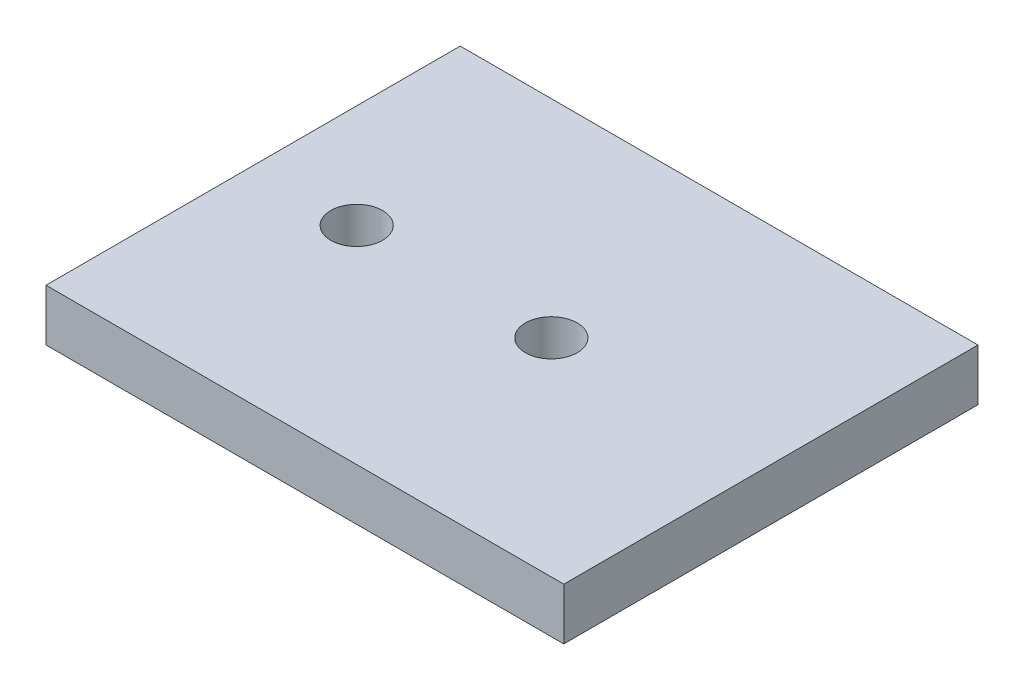
ISO-10303-21;
HEADER;
FILE_DESCRIPTION(('STEP AP214'),'2;1');
FILE_NAME('part.step','',(''),(''),'','','');
FILE_SCHEMA(('AUTOMOTIVE_DESIGN { 1 0 10303 214 1 1 1 1 }'));
ENDSEC;
DATA;
#1=APPLICATION_CONTEXT('core data for automotive mechanical design processes');
#2=APPLICATION_PROTOCOL_DEFINITION('international standard','automotive_design',2000,#1);
#3=PRODUCT_CONTEXT('',#1,'mechanical');
#4=PRODUCT('Part','Part','',(#3));
#5=PRODUCT_RELATED_PRODUCT_CATEGORY('part','',(#4));
#6=PRODUCT_DEFINITION_FORMATION('','',#4);
#7=PRODUCT_DEFINITION_CONTEXT('part definition',#1,'design');
#8=PRODUCT_DEFINITION('design','',#6,#7);
#9=PRODUCT_DEFINITION_SHAPE('','',#8);
#10=(LENGTH_UNIT() NAMED_UNIT(*) SI_UNIT(.MILLI.,.METRE.));
#11=(NAMED_UNIT(*) PLANE_ANGLE_UNIT() SI_UNIT($,.RADIAN.));
#12=(NAMED_UNIT(*) SI_UNIT($,.STERADIAN.) SOLID_ANGLE_UNIT());
#13=UNCERTAINTY_MEASURE_WITH_UNIT(LENGTH_MEASURE(1.E-05),#10,'distance_accuracy_value','');
#14=(GEOMETRIC_REPRESENTATION_CONTEXT(3) GLOBAL_UNCERTAINTY_ASSIGNED_CONTEXT((#13)) GLOBAL_UNIT_ASSIGNED_CONTEXT((#10,
#11,#12)) REPRESENTATION_CONTEXT('',''));
#15=CARTESIAN_POINT('',(0.,0.,0.));
#16=DIRECTION('',(0.,0.,1.));
#17=DIRECTION('',(1.,0.,0.));
#18=AXIS2_PLACEMENT_3D('',#15,#16,#17);
#19=CARTESIAN_POINT('',(63.5,12.7,-50.8));
#20=DIRECTION('',(-1.,0.,0.));
#21=DIRECTION('',(0.,0.,1.));
#22=AXIS2_PLACEMENT_3D('',#19,#20,#21);
#23=PLANE('',#22);
#24=DIRECTION('',(0.,0.,-1.));
#25=VECTOR('',#24,1.);
#26=CARTESIAN_POINT('',(63.5,0.,-50.8));
#27=LINE('',#26,#25);
#28=CARTESIAN_POINT('',(63.5,0.,50.8));
#29=VERTEX_POINT('',#28);
#30=CARTESIAN_POINT('',(63.5,0.,-50.8));
#31=VERTEX_POINT('',#30);
#32=EDGE_CURVE('E107',#29,#31,#27,.T.);
#33=ORIENTED_EDGE('',*,*,#32,.T.);
#34=DIRECTION('',(0.,-1.,0.));
#35=VECTOR('',#34,1.);
#36=CARTESIAN_POINT('',(63.5,12.7,-50.8));
#37=LINE('',#36,#35);
#38=CARTESIAN_POINT('',(63.5,12.7,-50.8));
#39=VERTEX_POINT('',#38);
#40=EDGE_CURVE('E11',#39,#31,#37,.T.);
#41=ORIENTED_EDGE('',*,*,#40,.F.);
#42=DIRECTION('',(0.,0.,-1.));
#43=VECTOR('',#42,1.);
#44=CARTESIAN_POINT('',(63.5,12.7,-50.8));
#45=LINE('',#44,#43);
#46=CARTESIAN_POINT('',(63.5,12.7,50.8));
#47=VERTEX_POINT('',#46);
#48=EDGE_CURVE('E91',#47,#39,#45,.T.);
#49=ORIENTED_EDGE('',*,*,#48,.F.);
#50=DIRECTION('',(0.,-1.,0.));
#51=VECTOR('',#50,1.);
#52=CARTESIAN_POINT('',(63.5,12.7,50.8));
#53=LINE('',#52,#51);
#54=EDGE_CURVE('E103',#47,#29,#53,.T.);
#55=ORIENTED_EDGE('',*,*,#54,.T.);
#56=EDGE_LOOP('',(#33,#41,#49,#55));
#57=FACE_BOUND('',#56,.T.);
#58=ADVANCED_FACE('F39',(#57),#23,.F.);
#59=CARTESIAN_POINT('',(-63.5,12.7,-50.8));
#60=DIRECTION('',(0.,0.,1.));
#61=DIRECTION('',(1.,0.,0.));
#62=AXIS2_PLACEMENT_3D('',#59,#60,#61);
#63=PLANE('',#62);
#64=DIRECTION('',(-1.,0.,0.));
#65=VECTOR('',#64,1.);
#66=CARTESIAN_POINT('',(-63.5,0.,-50.8));
#67=LINE('',#66,#65);
#68=CARTESIAN_POINT('',(-63.5,0.,-50.8));
#69=VERTEX_POINT('',#68);
#70=EDGE_CURVE('E96',#31,#69,#67,.T.);
#71=ORIENTED_EDGE('',*,*,#70,.T.);
#72=DIRECTION('',(0.,-1.,0.));
#73=VECTOR('',#72,1.);
#74=CARTESIAN_POINT('',(-63.5,12.7,-50.8));
#75=LINE('',#74,#73);
#76=CARTESIAN_POINT('',(-63.5,12.7,-50.8));
#77=VERTEX_POINT('',#76);
#78=EDGE_CURVE('E48',#77,#69,#75,.T.);
#79=ORIENTED_EDGE('',*,*,#78,.F.);
#80=DIRECTION('',(-1.,0.,0.));
#81=VECTOR('',#80,1.);
#82=CARTESIAN_POINT('',(-63.5,12.7,-50.8));
#83=LINE('',#82,#81);
#84=EDGE_CURVE('E86',#39,#77,#83,.T.);
#85=ORIENTED_EDGE('',*,*,#84,.F.);
#86=ORIENTED_EDGE('',*,*,#40,.T.);
#87=EDGE_LOOP('',(#71,#79,#85,#86));
#88=FACE_BOUND('',#87,.T.);
#89=ADVANCED_FACE('F95',(#88),#63,.F.);
#90=CARTESIAN_POINT('',(-63.5,12.7,-50.8));
#91=DIRECTION('',(1.,0.,0.));
#92=DIRECTION('',(0.,0.,-1.));
#93=AXIS2_PLACEMENT_3D('',#90,#91,#92);
#94=PLANE('',#93);
#95=DIRECTION('',(0.,0.,1.));
#96=VECTOR('',#95,1.);
#97=CARTESIAN_POINT('',(-63.5,0.,-50.8));
#98=LINE('',#97,#96);
#99=CARTESIAN_POINT('',(-63.5,0.,50.8));
#100=VERTEX_POINT('',#99);
#101=EDGE_CURVE('E73',#69,#100,#98,.T.);
#102=ORIENTED_EDGE('',*,*,#101,.T.);
#103=DIRECTION('',(0.,-1.,0.));
#104=VECTOR('',#103,1.);
#105=CARTESIAN_POINT('',(-63.5,12.7,50.8));
#106=LINE('',#105,#104);
#107=CARTESIAN_POINT('',(-63.5,12.7,50.8));
#108=VERTEX_POINT('',#107);
#109=EDGE_CURVE('E98',#108,#100,#106,.T.);
#110=ORIENTED_EDGE('',*,*,#109,.F.);
#111=DIRECTION('',(0.,0.,1.));
#112=VECTOR('',#111,1.);
#113=CARTESIAN_POINT('',(-63.5,12.7,-50.8));
#114=LINE('',#113,#112);
#115=EDGE_CURVE('E89',#77,#108,#114,.T.);
#116=ORIENTED_EDGE('',*,*,#115,.F.);
#117=ORIENTED_EDGE('',*,*,#78,.T.);
#118=EDGE_LOOP('',(#102,#110,#116,#117));
#119=FACE_BOUND('',#118,.T.);
#120=ADVANCED_FACE('F99',(#119),#94,.F.);
#121=CARTESIAN_POINT('',(-63.5,12.7,50.8));
#122=DIRECTION('',(0.,0.,-1.));
#123=DIRECTION('',(-1.,0.,0.));
#124=AXIS2_PLACEMENT_3D('',#121,#122,#123);
#125=PLANE('',#124);
#126=DIRECTION('',(1.,0.,0.));
#127=VECTOR('',#126,1.);
#128=CARTESIAN_POINT('',(-63.5,0.,50.8));
#129=LINE('',#128,#127);
#130=EDGE_CURVE('E79',#100,#29,#129,.T.);
#131=ORIENTED_EDGE('',*,*,#130,.T.);
#132=ORIENTED_EDGE('',*,*,#54,.F.);
#133=DIRECTION('',(1.,0.,0.));
#134=VECTOR('',#133,1.);
#135=CARTESIAN_POINT('',(-63.5,12.7,50.8));
#136=LINE('',#135,#134);
#137=EDGE_CURVE('E56',#108,#47,#136,.T.);
#138=ORIENTED_EDGE('',*,*,#137,.F.);
#139=ORIENTED_EDGE('',*,*,#109,.T.);
#140=EDGE_LOOP('',(#131,#132,#138,#139));
#141=FACE_BOUND('',#140,.T.);
#142=ADVANCED_FACE('F121',(#141),#125,.F.);
#143=CARTESIAN_POINT('',(0.,12.7,0.));
#144=DIRECTION('',(0.,1.,0.));
#145=DIRECTION('',(0.,0.,1.));
#146=AXIS2_PLACEMENT_3D('',#143,#144,#145);
#147=PLANE('',#146);
#148=CARTESIAN_POINT('',(-38.1,12.7,0.));
#149=DIRECTION('',(0.,1.,0.));
#150=DIRECTION('',(0.,0.,1.));
#151=AXIS2_PLACEMENT_3D('',#148,#149,#150);
#152=CIRCLE('',#151,6.35);
#153=CARTESIAN_POINT('',(-38.1,12.7,6.35));
#154=VERTEX_POINT('',#153);
#155=EDGE_CURVE('E136',#154,#154,#152,.T.);
#156=ORIENTED_EDGE('',*,*,#155,.F.);
#157=EDGE_LOOP('',(#156));
#158=FACE_BOUND('',#157,.T.);
#159=CARTESIAN_POINT('',(9.65199999999998,12.7,0.));
#160=DIRECTION('',(0.,1.,0.));
#161=DIRECTION('',(0.,0.,1.));
#162=AXIS2_PLACEMENT_3D('',#159,#160,#161);
#163=CIRCLE('',#162,6.35);
#164=CARTESIAN_POINT('',(9.65199999999998,12.7,6.35));
#165=VERTEX_POINT('',#164);
#166=EDGE_CURVE('E128',#165,#165,#163,.T.);
#167=ORIENTED_EDGE('',*,*,#166,.F.);
#168=EDGE_LOOP('',(#167));
#169=FACE_BOUND('',#168,.T.);
#170=ORIENTED_EDGE('',*,*,#48,.T.);
#171=ORIENTED_EDGE('',*,*,#84,.T.);
#172=ORIENTED_EDGE('',*,*,#115,.T.);
#173=ORIENTED_EDGE('',*,*,#137,.T.);
#174=EDGE_LOOP('',(#170,#171,#172,#173));
#175=FACE_BOUND('',#174,.T.);
#176=ADVANCED_FACE('F87',(#158,#169,#175),#147,.T.);
#177=CARTESIAN_POINT('',(0.,0.,0.));
#178=DIRECTION('',(0.,1.,0.));
#179=DIRECTION('',(0.,0.,1.));
#180=AXIS2_PLACEMENT_3D('',#177,#178,#179);
#181=PLANE('',#180);
#182=CARTESIAN_POINT('',(-38.1,0.,0.));
#183=DIRECTION('',(0.,1.,0.));
#184=DIRECTION('',(0.,0.,1.));
#185=AXIS2_PLACEMENT_3D('',#182,#183,#184);
#186=CIRCLE('',#185,6.35);
#187=CARTESIAN_POINT('',(-38.1,0.,6.35));
#188=VERTEX_POINT('',#187);
#189=EDGE_CURVE('E111',#188,#188,#186,.T.);
#190=ORIENTED_EDGE('',*,*,#189,.T.);
#191=EDGE_LOOP('',(#190));
#192=FACE_BOUND('',#191,.T.);
#193=CARTESIAN_POINT('',(9.65199999999998,0.,0.));
#194=DIRECTION('',(0.,1.,0.));
#195=DIRECTION('',(0.,0.,1.));
#196=AXIS2_PLACEMENT_3D('',#193,#194,#195);
#197=CIRCLE('',#196,6.35);
#198=CARTESIAN_POINT('',(9.65199999999998,0.,6.35));
#199=VERTEX_POINT('',#198);
#200=EDGE_CURVE('E132',#199,#199,#197,.T.);
#201=ORIENTED_EDGE('',*,*,#200,.T.);
#202=EDGE_LOOP('',(#201));
#203=FACE_BOUND('',#202,.T.);
#204=ORIENTED_EDGE('',*,*,#32,.F.);
#205=ORIENTED_EDGE('',*,*,#130,.F.);
#206=ORIENTED_EDGE('',*,*,#101,.F.);
#207=ORIENTED_EDGE('',*,*,#70,.F.);
#208=EDGE_LOOP('',(#204,#205,#206,#207));
#209=FACE_BOUND('',#208,.T.);
#210=ADVANCED_FACE('F124',(#192,#203,#209),#181,.F.);
#211=CARTESIAN_POINT('',(9.65199999999998,0.,0.));
#212=DIRECTION('',(0.,1.,0.));
#213=DIRECTION('',(0.,0.,1.));
#214=AXIS2_PLACEMENT_3D('',#211,#212,#213);
#215=CYLINDRICAL_SURFACE('',#214,6.35);
#216=ORIENTED_EDGE('',*,*,#200,.F.);
#217=EDGE_LOOP('',(#216));
#218=FACE_BOUND('',#217,.T.);
#219=ORIENTED_EDGE('',*,*,#166,.T.);
#220=EDGE_LOOP('',(#219));
#221=FACE_BOUND('',#220,.T.);
#222=ADVANCED_FACE('F149',(#218,#221),#215,.F.);
#223=CARTESIAN_POINT('',(-38.1,0.,0.));
#224=DIRECTION('',(0.,1.,0.));
#225=DIRECTION('',(0.,0.,1.));
#226=AXIS2_PLACEMENT_3D('',#223,#224,#225);
#227=CYLINDRICAL_SURFACE('',#226,6.35);
#228=ORIENTED_EDGE('',*,*,#189,.F.);
#229=EDGE_LOOP('',(#228));
#230=FACE_BOUND('',#229,.T.);
#231=ORIENTED_EDGE('',*,*,#155,.T.);
#232=EDGE_LOOP('',(#231));
#233=FACE_BOUND('',#232,.T.);
#234=ADVANCED_FACE('F146',(#230,#233),#227,.F.);
#235=CLOSED_SHELL('',(#58,#89,#120,#142,#176,#210,#222,#234));
#236=MANIFOLD_SOLID_BREP('B2',#235);
#237=ADVANCED_BREP_SHAPE_REPRESENTATION('',(#18,#236),#14);
#238=SHAPE_DEFINITION_REPRESENTATION(#9,#237);
ENDSEC;
END-ISO-10303-21;
